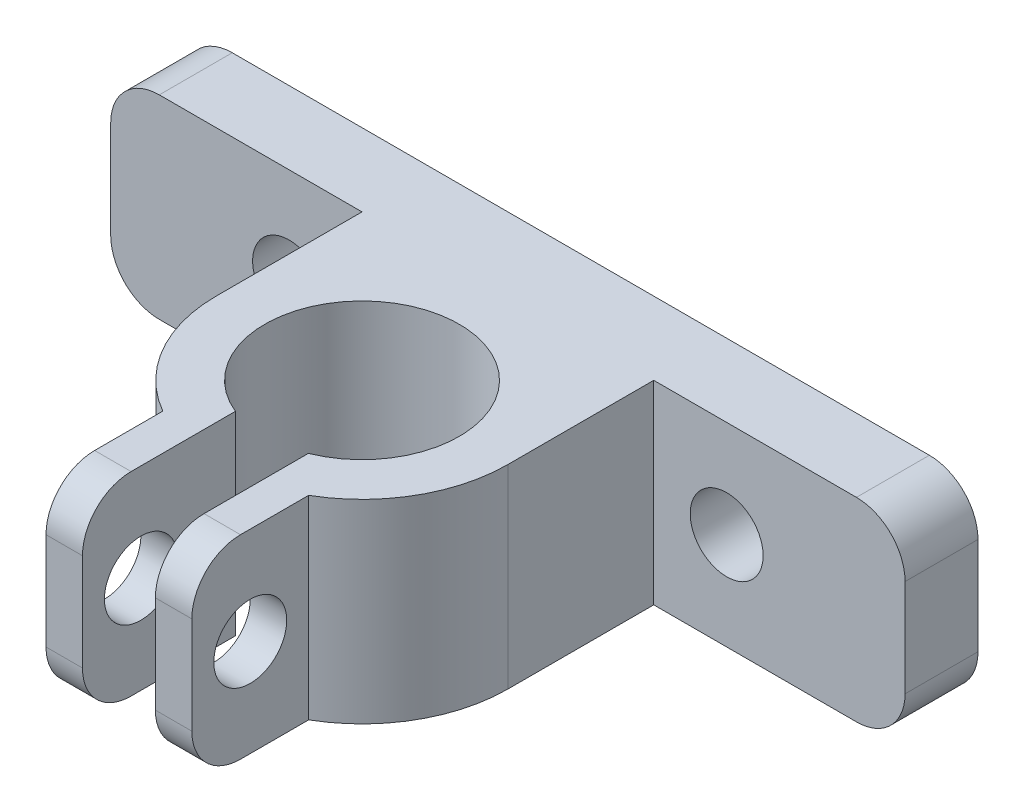
ISO-10303-21;
HEADER;
FILE_DESCRIPTION(('STEP AP214'),'2;1');
FILE_NAME('part.step','',(''),(''),'','','');
FILE_SCHEMA(('AUTOMOTIVE_DESIGN { 1 0 10303 214 1 1 1 1 }'));
ENDSEC;
DATA;
#1=APPLICATION_CONTEXT('core data for automotive mechanical design processes');
#2=APPLICATION_PROTOCOL_DEFINITION('international standard','automotive_design',2000,#1);
#3=PRODUCT_CONTEXT('',#1,'mechanical');
#4=PRODUCT('Part','Part','',(#3));
#5=PRODUCT_RELATED_PRODUCT_CATEGORY('part','',(#4));
#6=PRODUCT_DEFINITION_FORMATION('','',#4);
#7=PRODUCT_DEFINITION_CONTEXT('part definition',#1,'design');
#8=PRODUCT_DEFINITION('design','',#6,#7);
#9=PRODUCT_DEFINITION_SHAPE('','',#8);
#10=(LENGTH_UNIT() NAMED_UNIT(*) SI_UNIT(.MILLI.,.METRE.));
#11=(NAMED_UNIT(*) PLANE_ANGLE_UNIT() SI_UNIT($,.RADIAN.));
#12=(NAMED_UNIT(*) SI_UNIT($,.STERADIAN.) SOLID_ANGLE_UNIT());
#13=UNCERTAINTY_MEASURE_WITH_UNIT(LENGTH_MEASURE(1.E-05),#10,'distance_accuracy_value','');
#14=(GEOMETRIC_REPRESENTATION_CONTEXT(3) GLOBAL_UNCERTAINTY_ASSIGNED_CONTEXT((#13)) GLOBAL_UNIT_ASSIGNED_CONTEXT((#10,
#11,#12)) REPRESENTATION_CONTEXT('',''));
#15=CARTESIAN_POINT('',(0.,0.,0.));
#16=DIRECTION('',(0.,0.,1.));
#17=DIRECTION('',(1.,0.,0.));
#18=AXIS2_PLACEMENT_3D('',#15,#16,#17);
#19=CARTESIAN_POINT('',(-0.72669735327965,38.8438560633776,16.));
#20=DIRECTION('',(0.,0.,1.));
#21=DIRECTION('',(1.,0.,0.));
#22=AXIS2_PLACEMENT_3D('',#19,#20,#21);
#23=PLANE('',#22);
#24=DIRECTION('',(0.,1.,0.));
#25=VECTOR('',#24,1.);
#26=CARTESIAN_POINT('',(-2.22669735327965,38.8438560633776,16.));
#27=LINE('',#26,#25);
#28=CARTESIAN_POINT('',(-2.22669735327965,24.358574689139,16.));
#29=VERTEX_POINT('',#28);
#30=CARTESIAN_POINT('',(-2.22669735327965,28.358574689139,16.));
#31=VERTEX_POINT('',#30);
#32=EDGE_CURVE('E311',#29,#31,#27,.T.);
#33=ORIENTED_EDGE('',*,*,#32,.F.);
#34=DIRECTION('',(-1.,0.,0.));
#35=VECTOR('',#34,1.);
#36=CARTESIAN_POINT('',(-0.72669735327965,24.358574689139,16.));
#37=LINE('',#36,#35);
#38=CARTESIAN_POINT('',(-0.72669735327965,24.358574689139,16.));
#39=VERTEX_POINT('',#38);
#40=EDGE_CURVE('E66',#29,#39,#37,.F.);
#41=ORIENTED_EDGE('',*,*,#40,.T.);
#42=DIRECTION('',(0.,-1.,0.));
#43=VECTOR('',#42,1.);
#44=CARTESIAN_POINT('',(-0.72669735327965,38.8438560633776,16.));
#45=LINE('',#44,#43);
#46=CARTESIAN_POINT('',(-0.72669735327965,28.358574689139,16.));
#47=VERTEX_POINT('',#46);
#48=EDGE_CURVE('E384',#47,#39,#45,.T.);
#49=ORIENTED_EDGE('',*,*,#48,.F.);
#50=DIRECTION('',(-1.,0.,0.));
#51=VECTOR('',#50,1.);
#52=CARTESIAN_POINT('',(-0.726697353279648,28.358574689139,16.));
#53=LINE('',#52,#51);
#54=EDGE_CURVE('E380',#47,#31,#53,.T.);
#55=ORIENTED_EDGE('',*,*,#54,.T.);
#56=EDGE_LOOP('',(#33,#41,#49,#55));
#57=FACE_BOUND('',#56,.T.);
#58=ADVANCED_FACE('F51',(#57),#23,.T.);
#59=CARTESIAN_POINT('',(-3.72669735327962,47.3291374376162,6.));
#60=DIRECTION('',(0.,-1.,0.));
#61=DIRECTION('',(0.,0.,-1.));
#62=AXIS2_PLACEMENT_3D('',#59,#60,#61);
#63=CYLINDRICAL_SURFACE('',#62,6.);
#64=DIRECTION('',(0.,-1.,0.));
#65=VECTOR('',#64,1.);
#66=CARTESIAN_POINT('',(-6.72669735327966,47.3291374376162,11.1961524227066));
#67=LINE('',#66,#65);
#68=CARTESIAN_POINT('',(-6.72669735327966,30.358574689139,11.1961524227066));
#69=VERTEX_POINT('',#68);
#70=CARTESIAN_POINT('',(-6.72669735327966,22.358574689139,11.1961524227066));
#71=VERTEX_POINT('',#70);
#72=EDGE_CURVE('E305',#69,#71,#67,.T.);
#73=ORIENTED_EDGE('',*,*,#72,.F.);
#74=CARTESIAN_POINT('',(-3.72669735327962,30.358574689139,6.));
#75=DIRECTION('',(0.,1.,0.));
#76=DIRECTION('',(-1.,0.,0.));
#77=AXIS2_PLACEMENT_3D('',#74,#75,#76);
#78=CIRCLE('',#77,6.);
#79=CARTESIAN_POINT('',(-9.72669735327963,30.358574689139,6.));
#80=VERTEX_POINT('',#79);
#81=EDGE_CURVE('E252',#69,#80,#78,.F.);
#82=ORIENTED_EDGE('',*,*,#81,.T.);
#83=DIRECTION('',(0.,-1.,0.));
#84=VECTOR('',#83,1.);
#85=CARTESIAN_POINT('',(-9.72669735327963,38.8438560633776,6.));
#86=LINE('',#85,#84);
#87=CARTESIAN_POINT('',(-9.72669735327963,22.358574689139,6.));
#88=VERTEX_POINT('',#87);
#89=EDGE_CURVE('E246',#80,#88,#86,.T.);
#90=ORIENTED_EDGE('',*,*,#89,.T.);
#91=CARTESIAN_POINT('',(-3.72669735327962,22.358574689139,6.));
#92=DIRECTION('',(0.,-1.,0.));
#93=DIRECTION('',(0.,0.,-1.));
#94=AXIS2_PLACEMENT_3D('',#91,#92,#93);
#95=CIRCLE('',#94,6.);
#96=EDGE_CURVE('E243',#71,#88,#95,.T.);
#97=ORIENTED_EDGE('',*,*,#96,.F.);
#98=EDGE_LOOP('',(#73,#82,#90,#97));
#99=FACE_BOUND('',#98,.T.);
#100=ADVANCED_FACE('F503',(#99),#63,.T.);
#101=CARTESIAN_POINT('',(0.,0.,0.));
#102=DIRECTION('',(0.,0.,1.));
#103=DIRECTION('',(1.,0.,0.));
#104=AXIS2_PLACEMENT_3D('',#101,#102,#103);
#105=PLANE('',#104);
#106=CARTESIAN_POINT('',(5.27330264672038,26.358574689139,0.));
#107=DIRECTION('',(0.,0.,1.));
#108=DIRECTION('',(1.,0.,0.));
#109=AXIS2_PLACEMENT_3D('',#106,#107,#108);
#110=CIRCLE('',#109,1.5);
#111=CARTESIAN_POINT('',(6.77330264672038,26.358574689139,0.));
#112=VERTEX_POINT('',#111);
#113=EDGE_CURVE('E263',#112,#112,#110,.T.);
#114=ORIENTED_EDGE('',*,*,#113,.F.);
#115=EDGE_LOOP('',(#114));
#116=FACE_BOUND('',#115,.T.);
#117=DIRECTION('',(1.,0.,0.));
#118=VECTOR('',#117,1.);
#119=CARTESIAN_POINT('',(-20.0653915042754,22.358574689139,0.));
#120=LINE('',#119,#118);
#121=CARTESIAN_POINT('',(2.27330264672038,22.358574689139,0.));
#122=VERTEX_POINT('',#121);
#123=CARTESIAN_POINT('',(10.6119967977161,22.358574689139,0.));
#124=VERTEX_POINT('',#123);
#125=EDGE_CURVE('E301',#122,#124,#120,.T.);
#126=ORIENTED_EDGE('',*,*,#125,.T.);
#127=CARTESIAN_POINT('',(10.6119967977161,24.358574689139,0.));
#128=DIRECTION('',(0.,0.,1.));
#129=DIRECTION('',(1.,0.,0.));
#130=AXIS2_PLACEMENT_3D('',#127,#128,#129);
#131=CIRCLE('',#130,2.);
#132=CARTESIAN_POINT('',(12.6119967977161,24.358574689139,0.));
#133=VERTEX_POINT('',#132);
#134=EDGE_CURVE('E326',#124,#133,#131,.T.);
#135=ORIENTED_EDGE('',*,*,#134,.T.);
#136=DIRECTION('',(0.,1.,0.));
#137=VECTOR('',#136,1.);
#138=CARTESIAN_POINT('',(12.6119967977161,30.358574689139,0.));
#139=LINE('',#138,#137);
#140=CARTESIAN_POINT('',(12.6119967977161,28.358574689139,0.));
#141=VERTEX_POINT('',#140);
#142=EDGE_CURVE('E270',#133,#141,#139,.T.);
#143=ORIENTED_EDGE('',*,*,#142,.T.);
#144=CARTESIAN_POINT('',(10.6119967977161,28.358574689139,0.));
#145=DIRECTION('',(0.,0.,1.));
#146=DIRECTION('',(1.,0.,0.));
#147=AXIS2_PLACEMENT_3D('',#144,#145,#146);
#148=CIRCLE('',#147,2.);
#149=CARTESIAN_POINT('',(10.6119967977161,30.358574689139,0.));
#150=VERTEX_POINT('',#149);
#151=EDGE_CURVE('E324',#141,#150,#148,.T.);
#152=ORIENTED_EDGE('',*,*,#151,.T.);
#153=DIRECTION('',(-1.,0.,0.));
#154=VECTOR('',#153,1.);
#155=CARTESIAN_POINT('',(-20.0653915042754,30.358574689139,0.));
#156=LINE('',#155,#154);
#157=CARTESIAN_POINT('',(2.27330264672038,30.358574689139,0.));
#158=VERTEX_POINT('',#157);
#159=EDGE_CURVE('E296',#150,#158,#156,.T.);
#160=ORIENTED_EDGE('',*,*,#159,.T.);
#161=DIRECTION('',(0.,-1.,0.));
#162=VECTOR('',#161,1.);
#163=CARTESIAN_POINT('',(2.27330264672038,38.8438560633776,0.));
#164=LINE('',#163,#162);
#165=EDGE_CURVE('E255',#158,#122,#164,.T.);
#166=ORIENTED_EDGE('',*,*,#165,.T.);
#167=EDGE_LOOP('',(#126,#135,#143,#152,#160,#166));
#168=FACE_BOUND('',#167,.T.);
#169=ADVANCED_FACE('F462',(#116,#168),#105,.T.);
#170=CARTESIAN_POINT('',(12.6119967977161,30.358574689139,-3.));
#171=DIRECTION('',(1.,0.,0.));
#172=DIRECTION('',(0.,1.,0.));
#173=AXIS2_PLACEMENT_3D('',#170,#171,#172);
#174=PLANE('',#173);
#175=ORIENTED_EDGE('',*,*,#142,.F.);
#176=DIRECTION('',(0.,0.,1.));
#177=VECTOR('',#176,1.);
#178=CARTESIAN_POINT('',(12.6119967977161,24.358574689139,-3.));
#179=LINE('',#178,#177);
#180=CARTESIAN_POINT('',(12.6119967977161,24.358574689139,-3.));
#181=VERTEX_POINT('',#180);
#182=EDGE_CURVE('E331',#133,#181,#179,.F.);
#183=ORIENTED_EDGE('',*,*,#182,.T.);
#184=DIRECTION('',(0.,1.,0.));
#185=VECTOR('',#184,1.);
#186=CARTESIAN_POINT('',(12.6119967977161,30.358574689139,-3.));
#187=LINE('',#186,#185);
#188=CARTESIAN_POINT('',(12.6119967977161,28.358574689139,-3.));
#189=VERTEX_POINT('',#188);
#190=EDGE_CURVE('E279',#181,#189,#187,.T.);
#191=ORIENTED_EDGE('',*,*,#190,.T.);
#192=DIRECTION('',(0.,0.,1.));
#193=VECTOR('',#192,1.);
#194=CARTESIAN_POINT('',(12.6119967977161,28.358574689139,-3.));
#195=LINE('',#194,#193);
#196=EDGE_CURVE('E328',#189,#141,#195,.T.);
#197=ORIENTED_EDGE('',*,*,#196,.T.);
#198=EDGE_LOOP('',(#175,#183,#191,#197));
#199=FACE_BOUND('',#198,.T.);
#200=ADVANCED_FACE('F454',(#199),#174,.T.);
#201=CARTESIAN_POINT('',(-20.0653915042754,22.358574689139,-3.));
#202=DIRECTION('',(0.,-1.,0.));
#203=DIRECTION('',(0.,0.,-1.));
#204=AXIS2_PLACEMENT_3D('',#201,#202,#203);
#205=PLANE('',#204);
#206=DIRECTION('',(0.,0.,-1.));
#207=VECTOR('',#206,1.);
#208=CARTESIAN_POINT('',(-5.22669735327965,22.358574689139,6.));
#209=LINE('',#208,#207);
#210=CARTESIAN_POINT('',(-5.22669735327965,22.358574689139,14.));
#211=VERTEX_POINT('',#210);
#212=CARTESIAN_POINT('',(-5.22669735327965,22.358574689139,9.70809924354782));
#213=VERTEX_POINT('',#212);
#214=EDGE_CURVE('E234',#211,#213,#209,.T.);
#215=ORIENTED_EDGE('',*,*,#214,.F.);
#216=DIRECTION('',(-1.,0.,0.));
#217=VECTOR('',#216,1.);
#218=CARTESIAN_POINT('',(-20.0653915042754,22.358574689139,14.));
#219=LINE('',#218,#217);
#220=CARTESIAN_POINT('',(-6.72669735327966,22.358574689139,14.));
#221=VERTEX_POINT('',#220);
#222=EDGE_CURVE('E373',#211,#221,#219,.T.);
#223=ORIENTED_EDGE('',*,*,#222,.T.);
#224=DIRECTION('',(0.,0.,-1.));
#225=VECTOR('',#224,1.);
#226=CARTESIAN_POINT('',(-6.72669735327967,22.358574689139,10.));
#227=LINE('',#226,#225);
#228=EDGE_CURVE('E392',#221,#71,#227,.T.);
#229=ORIENTED_EDGE('',*,*,#228,.T.);
#230=ORIENTED_EDGE('',*,*,#96,.T.);
#231=DIRECTION('',(0.,0.,-1.));
#232=VECTOR('',#231,1.);
#233=CARTESIAN_POINT('',(-9.72669735327963,22.358574689139,6.));
#234=LINE('',#233,#232);
#235=CARTESIAN_POINT('',(-9.72669735327963,22.358574689139,0.));
#236=VERTEX_POINT('',#235);
#237=EDGE_CURVE('E241',#88,#236,#234,.T.);
#238=ORIENTED_EDGE('',*,*,#237,.T.);
#239=CARTESIAN_POINT('',(-18.0653915042754,22.358574689139,0.));
#240=VERTEX_POINT('',#239);
#241=EDGE_CURVE('E283',#240,#236,#120,.T.);
#242=ORIENTED_EDGE('',*,*,#241,.F.);
#243=DIRECTION('',(0.,0.,1.));
#244=VECTOR('',#243,1.);
#245=CARTESIAN_POINT('',(-18.0653915042754,22.358574689139,-3.));
#246=LINE('',#245,#244);
#247=CARTESIAN_POINT('',(-18.0653915042754,22.358574689139,-3.));
#248=VERTEX_POINT('',#247);
#249=EDGE_CURVE('E314',#240,#248,#246,.F.);
#250=ORIENTED_EDGE('',*,*,#249,.T.);
#251=DIRECTION('',(1.,0.,0.));
#252=VECTOR('',#251,1.);
#253=CARTESIAN_POINT('',(-20.0653915042754,22.358574689139,-3.));
#254=LINE('',#253,#252);
#255=CARTESIAN_POINT('',(10.6119967977161,22.358574689139,-3.));
#256=VERTEX_POINT('',#255);
#257=EDGE_CURVE('E289',#248,#256,#254,.T.);
#258=ORIENTED_EDGE('',*,*,#257,.T.);
#259=DIRECTION('',(0.,0.,1.));
#260=VECTOR('',#259,1.);
#261=CARTESIAN_POINT('',(10.6119967977161,22.358574689139,-3.));
#262=LINE('',#261,#260);
#263=EDGE_CURVE('E321',#256,#124,#262,.T.);
#264=ORIENTED_EDGE('',*,*,#263,.T.);
#265=ORIENTED_EDGE('',*,*,#125,.F.);
#266=DIRECTION('',(0.,0.,-1.));
#267=VECTOR('',#266,1.);
#268=CARTESIAN_POINT('',(2.27330264672038,22.358574689139,6.));
#269=LINE('',#268,#267);
#270=CARTESIAN_POINT('',(2.27330264672038,22.358574689139,6.));
#271=VERTEX_POINT('',#270);
#272=EDGE_CURVE('E256',#271,#122,#269,.T.);
#273=ORIENTED_EDGE('',*,*,#272,.F.);
#274=CARTESIAN_POINT('',(-0.726697353279651,22.358574689139,11.1961524227066));
#275=VERTEX_POINT('',#274);
#276=EDGE_CURVE('E249',#271,#275,#95,.T.);
#277=ORIENTED_EDGE('',*,*,#276,.T.);
#278=DIRECTION('',(0.,0.,1.));
#279=VECTOR('',#278,1.);
#280=CARTESIAN_POINT('',(-0.726697353279652,22.358574689139,10.));
#281=LINE('',#280,#279);
#282=CARTESIAN_POINT('',(-0.726697353279651,22.358574689139,14.));
#283=VERTEX_POINT('',#282);
#284=EDGE_CURVE('E222',#275,#283,#281,.T.);
#285=ORIENTED_EDGE('',*,*,#284,.T.);
#286=DIRECTION('',(-1.,0.,0.));
#287=VECTOR('',#286,1.);
#288=CARTESIAN_POINT('',(-20.0653915042754,22.358574689139,14.));
#289=LINE('',#288,#287);
#290=CARTESIAN_POINT('',(-2.22669735327964,22.358574689139,14.));
#291=VERTEX_POINT('',#290);
#292=EDGE_CURVE('E233',#283,#291,#289,.T.);
#293=ORIENTED_EDGE('',*,*,#292,.T.);
#294=DIRECTION('',(0.,0.,1.));
#295=VECTOR('',#294,1.);
#296=CARTESIAN_POINT('',(-2.2266973532796,22.358574689139,6.));
#297=LINE('',#296,#295);
#298=CARTESIAN_POINT('',(-2.22669735327962,22.358574689139,9.70809924354783));
#299=VERTEX_POINT('',#298);
#300=EDGE_CURVE('E215',#299,#291,#297,.T.);
#301=ORIENTED_EDGE('',*,*,#300,.F.);
#302=CARTESIAN_POINT('',(-3.72669735327962,22.358574689139,6.));
#303=DIRECTION('',(0.,-1.,0.));
#304=DIRECTION('',(0.,0.,-1.));
#305=AXIS2_PLACEMENT_3D('',#302,#303,#304);
#306=CIRCLE('',#305,4.);
#307=EDGE_CURVE('E230',#213,#299,#306,.T.);
#308=ORIENTED_EDGE('',*,*,#307,.F.);
#309=EDGE_LOOP('',(#215,#223,#229,#230,#238,#242,#250,#258,#264,#265,#273,#277,#285,#293,#301,#308));
#310=FACE_BOUND('',#309,.T.);
#311=ADVANCED_FACE('F229',(#310),#205,.T.);
#312=CARTESIAN_POINT('',(-20.0653915042754,30.358574689139,-3.));
#313=DIRECTION('',(-1.,0.,0.));
#314=DIRECTION('',(0.,0.,1.));
#315=AXIS2_PLACEMENT_3D('',#312,#313,#314);
#316=PLANE('',#315);
#317=DIRECTION('',(0.,-1.,0.));
#318=VECTOR('',#317,1.);
#319=CARTESIAN_POINT('',(-20.0653915042754,30.358574689139,-3.));
#320=LINE('',#319,#318);
#321=CARTESIAN_POINT('',(-20.0653915042754,28.358574689139,-3.));
#322=VERTEX_POINT('',#321);
#323=CARTESIAN_POINT('',(-20.0653915042754,24.358574689139,-3.));
#324=VERTEX_POINT('',#323);
#325=EDGE_CURVE('E286',#322,#324,#320,.T.);
#326=ORIENTED_EDGE('',*,*,#325,.T.);
#327=DIRECTION('',(0.,0.,1.));
#328=VECTOR('',#327,1.);
#329=CARTESIAN_POINT('',(-20.0653915042754,24.358574689139,-3.));
#330=LINE('',#329,#328);
#331=CARTESIAN_POINT('',(-20.0653915042754,24.358574689139,0.));
#332=VERTEX_POINT('',#331);
#333=EDGE_CURVE('E348',#324,#332,#330,.T.);
#334=ORIENTED_EDGE('',*,*,#333,.T.);
#335=DIRECTION('',(0.,-1.,0.));
#336=VECTOR('',#335,1.);
#337=CARTESIAN_POINT('',(-20.0653915042754,30.358574689139,0.));
#338=LINE('',#337,#336);
#339=CARTESIAN_POINT('',(-20.0653915042754,28.358574689139,0.));
#340=VERTEX_POINT('',#339);
#341=EDGE_CURVE('E298',#340,#332,#338,.T.);
#342=ORIENTED_EDGE('',*,*,#341,.F.);
#343=DIRECTION('',(0.,0.,1.));
#344=VECTOR('',#343,1.);
#345=CARTESIAN_POINT('',(-20.0653915042754,28.358574689139,-3.));
#346=LINE('',#345,#344);
#347=EDGE_CURVE('E346',#340,#322,#346,.F.);
#348=ORIENTED_EDGE('',*,*,#347,.T.);
#349=EDGE_LOOP('',(#326,#334,#342,#348));
#350=FACE_BOUND('',#349,.T.);
#351=ADVANCED_FACE('F440',(#350),#316,.T.);
#352=CARTESIAN_POINT('',(-20.0653915042754,30.358574689139,-3.));
#353=DIRECTION('',(0.,1.,0.));
#354=DIRECTION('',(-1.,0.,0.));
#355=AXIS2_PLACEMENT_3D('',#352,#353,#354);
#356=PLANE('',#355);
#357=DIRECTION('',(0.,0.,-1.));
#358=VECTOR('',#357,1.);
#359=CARTESIAN_POINT('',(-6.72669735327967,30.358574689139,10.));
#360=LINE('',#359,#358);
#361=CARTESIAN_POINT('',(-6.72669735327966,30.358574689139,14.));
#362=VERTEX_POINT('',#361);
#363=EDGE_CURVE('E399',#362,#69,#360,.T.);
#364=ORIENTED_EDGE('',*,*,#363,.F.);
#365=DIRECTION('',(-1.,0.,0.));
#366=VECTOR('',#365,1.);
#367=CARTESIAN_POINT('',(-20.0653915042754,30.358574689139,14.));
#368=LINE('',#367,#366);
#369=CARTESIAN_POINT('',(-5.22669735327965,30.358574689139,14.));
#370=VERTEX_POINT('',#369);
#371=EDGE_CURVE('E366',#362,#370,#368,.F.);
#372=ORIENTED_EDGE('',*,*,#371,.T.);
#373=DIRECTION('',(0.,0.,-1.));
#374=VECTOR('',#373,1.);
#375=CARTESIAN_POINT('',(-5.22669735327965,30.358574689139,6.));
#376=LINE('',#375,#374);
#377=CARTESIAN_POINT('',(-5.22669735327965,30.358574689139,9.70809924354782));
#378=VERTEX_POINT('',#377);
#379=EDGE_CURVE('E472',#370,#378,#376,.T.);
#380=ORIENTED_EDGE('',*,*,#379,.T.);
#381=CARTESIAN_POINT('',(-3.72669735327962,30.358574689139,6.));
#382=DIRECTION('',(0.,-1.,0.));
#383=DIRECTION('',(0.,0.,-1.));
#384=AXIS2_PLACEMENT_3D('',#381,#382,#383);
#385=CIRCLE('',#384,4.);
#386=CARTESIAN_POINT('',(-2.22669735327962,30.358574689139,9.70809924354783));
#387=VERTEX_POINT('',#386);
#388=EDGE_CURVE('E240',#378,#387,#385,.T.);
#389=ORIENTED_EDGE('',*,*,#388,.T.);
#390=DIRECTION('',(0.,0.,1.));
#391=VECTOR('',#390,1.);
#392=CARTESIAN_POINT('',(-2.2266973532796,30.358574689139,6.));
#393=LINE('',#392,#391);
#394=CARTESIAN_POINT('',(-2.22669735327964,30.358574689139,14.));
#395=VERTEX_POINT('',#394);
#396=EDGE_CURVE('E217',#387,#395,#393,.T.);
#397=ORIENTED_EDGE('',*,*,#396,.T.);
#398=DIRECTION('',(-1.,0.,0.));
#399=VECTOR('',#398,1.);
#400=CARTESIAN_POINT('',(-20.0653915042754,30.358574689139,14.));
#401=LINE('',#400,#399);
#402=CARTESIAN_POINT('',(-0.726697353279651,30.358574689139,14.));
#403=VERTEX_POINT('',#402);
#404=EDGE_CURVE('E364',#395,#403,#401,.F.);
#405=ORIENTED_EDGE('',*,*,#404,.T.);
#406=DIRECTION('',(0.,0.,1.));
#407=VECTOR('',#406,1.);
#408=CARTESIAN_POINT('',(-0.726697353279652,30.358574689139,10.));
#409=LINE('',#408,#407);
#410=CARTESIAN_POINT('',(-0.726697353279652,30.358574689139,11.1961524227066));
#411=VERTEX_POINT('',#410);
#412=EDGE_CURVE('E397',#411,#403,#409,.T.);
#413=ORIENTED_EDGE('',*,*,#412,.F.);
#414=CARTESIAN_POINT('',(2.27330264672038,30.358574689139,6.));
#415=VERTEX_POINT('',#414);
#416=EDGE_CURVE('E253',#415,#411,#78,.F.);
#417=ORIENTED_EDGE('',*,*,#416,.F.);
#418=DIRECTION('',(0.,0.,-1.));
#419=VECTOR('',#418,1.);
#420=CARTESIAN_POINT('',(2.27330264672038,30.358574689139,6.));
#421=LINE('',#420,#419);
#422=EDGE_CURVE('E259',#415,#158,#421,.T.);
#423=ORIENTED_EDGE('',*,*,#422,.T.);
#424=ORIENTED_EDGE('',*,*,#159,.F.);
#425=DIRECTION('',(0.,0.,1.));
#426=VECTOR('',#425,1.);
#427=CARTESIAN_POINT('',(10.6119967977161,30.358574689139,-3.));
#428=LINE('',#427,#426);
#429=CARTESIAN_POINT('',(10.6119967977161,30.358574689139,-3.));
#430=VERTEX_POINT('',#429);
#431=EDGE_CURVE('E344',#150,#430,#428,.F.);
#432=ORIENTED_EDGE('',*,*,#431,.T.);
#433=DIRECTION('',(-1.,0.,0.));
#434=VECTOR('',#433,1.);
#435=CARTESIAN_POINT('',(-20.0653915042754,30.358574689139,-3.));
#436=LINE('',#435,#434);
#437=CARTESIAN_POINT('',(-18.0653915042754,30.358574689139,-3.));
#438=VERTEX_POINT('',#437);
#439=EDGE_CURVE('E282',#430,#438,#436,.T.);
#440=ORIENTED_EDGE('',*,*,#439,.T.);
#441=DIRECTION('',(0.,0.,1.));
#442=VECTOR('',#441,1.);
#443=CARTESIAN_POINT('',(-18.0653915042754,30.358574689139,-3.));
#444=LINE('',#443,#442);
#445=CARTESIAN_POINT('',(-18.0653915042754,30.358574689139,0.));
#446=VERTEX_POINT('',#445);
#447=EDGE_CURVE('E341',#438,#446,#444,.T.);
#448=ORIENTED_EDGE('',*,*,#447,.T.);
#449=CARTESIAN_POINT('',(-9.72669735327963,30.358574689139,0.));
#450=VERTEX_POINT('',#449);
#451=EDGE_CURVE('E295',#450,#446,#156,.T.);
#452=ORIENTED_EDGE('',*,*,#451,.F.);
#453=DIRECTION('',(0.,0.,-1.));
#454=VECTOR('',#453,1.);
#455=CARTESIAN_POINT('',(-9.72669735327963,30.358574689139,6.));
#456=LINE('',#455,#454);
#457=EDGE_CURVE('E407',#80,#450,#456,.T.);
#458=ORIENTED_EDGE('',*,*,#457,.F.);
#459=ORIENTED_EDGE('',*,*,#81,.F.);
#460=EDGE_LOOP('',(#364,#372,#380,#389,#397,#405,#413,#417,#423,#424,#432,#440,#448,#452,#458,#459));
#461=FACE_BOUND('',#460,.T.);
#462=ADVANCED_FACE('F420',(#461),#356,.T.);
#463=CARTESIAN_POINT('',(0.,0.,-3.));
#464=DIRECTION('',(0.,0.,1.));
#465=DIRECTION('',(1.,0.,0.));
#466=AXIS2_PLACEMENT_3D('',#463,#464,#465);
#467=PLANE('',#466);
#468=CARTESIAN_POINT('',(-12.7266973532796,26.358574689139,-3.));
#469=DIRECTION('',(0.,0.,1.));
#470=DIRECTION('',(1.,0.,0.));
#471=AXIS2_PLACEMENT_3D('',#468,#469,#470);
#472=CIRCLE('',#471,1.5);
#473=CARTESIAN_POINT('',(-11.2266973532796,26.358574689139,-3.));
#474=VERTEX_POINT('',#473);
#475=EDGE_CURVE('E267',#474,#474,#472,.T.);
#476=ORIENTED_EDGE('',*,*,#475,.T.);
#477=EDGE_LOOP('',(#476));
#478=FACE_BOUND('',#477,.T.);
#479=CARTESIAN_POINT('',(5.27330264672038,26.358574689139,-3.));
#480=DIRECTION('',(0.,0.,1.));
#481=DIRECTION('',(1.,0.,0.));
#482=AXIS2_PLACEMENT_3D('',#479,#480,#481);
#483=CIRCLE('',#482,1.5);
#484=CARTESIAN_POINT('',(6.77330264672038,26.358574689139,-3.));
#485=VERTEX_POINT('',#484);
#486=EDGE_CURVE('E274',#485,#485,#483,.T.);
#487=ORIENTED_EDGE('',*,*,#486,.T.);
#488=EDGE_LOOP('',(#487));
#489=FACE_BOUND('',#488,.T.);
#490=ORIENTED_EDGE('',*,*,#190,.F.);
#491=CARTESIAN_POINT('',(10.6119967977161,24.358574689139,-3.));
#492=DIRECTION('',(0.,0.,1.));
#493=DIRECTION('',(1.,0.,0.));
#494=AXIS2_PLACEMENT_3D('',#491,#492,#493);
#495=CIRCLE('',#494,2.);
#496=EDGE_CURVE('E339',#181,#256,#495,.F.);
#497=ORIENTED_EDGE('',*,*,#496,.T.);
#498=ORIENTED_EDGE('',*,*,#257,.F.);
#499=CARTESIAN_POINT('',(-18.0653915042754,24.358574689139,-3.));
#500=DIRECTION('',(0.,0.,1.));
#501=DIRECTION('',(1.,0.,0.));
#502=AXIS2_PLACEMENT_3D('',#499,#500,#501);
#503=CIRCLE('',#502,2.);
#504=EDGE_CURVE('E335',#248,#324,#503,.F.);
#505=ORIENTED_EDGE('',*,*,#504,.T.);
#506=ORIENTED_EDGE('',*,*,#325,.F.);
#507=CARTESIAN_POINT('',(-18.0653915042754,28.358574689139,-3.));
#508=DIRECTION('',(0.,0.,1.));
#509=DIRECTION('',(1.,0.,0.));
#510=AXIS2_PLACEMENT_3D('',#507,#508,#509);
#511=CIRCLE('',#510,2.);
#512=EDGE_CURVE('E333',#322,#438,#511,.F.);
#513=ORIENTED_EDGE('',*,*,#512,.T.);
#514=ORIENTED_EDGE('',*,*,#439,.F.);
#515=CARTESIAN_POINT('',(10.6119967977161,28.358574689139,-3.));
#516=DIRECTION('',(0.,0.,1.));
#517=DIRECTION('',(1.,0.,0.));
#518=AXIS2_PLACEMENT_3D('',#515,#516,#517);
#519=CIRCLE('',#518,2.);
#520=EDGE_CURVE('E337',#430,#189,#519,.F.);
#521=ORIENTED_EDGE('',*,*,#520,.T.);
#522=EDGE_LOOP('',(#490,#497,#498,#505,#506,#513,#514,#521));
#523=FACE_BOUND('',#522,.T.);
#524=ADVANCED_FACE('F437',(#478,#489,#523),#467,.F.);
#525=ORIENTED_EDGE('',*,*,#341,.T.);
#526=CARTESIAN_POINT('',(-18.0653915042754,24.358574689139,0.));
#527=DIRECTION('',(0.,0.,1.));
#528=DIRECTION('',(1.,0.,0.));
#529=AXIS2_PLACEMENT_3D('',#526,#527,#528);
#530=CIRCLE('',#529,2.);
#531=EDGE_CURVE('E353',#332,#240,#530,.T.);
#532=ORIENTED_EDGE('',*,*,#531,.T.);
#533=ORIENTED_EDGE('',*,*,#241,.T.);
#534=DIRECTION('',(0.,-1.,0.));
#535=VECTOR('',#534,1.);
#536=CARTESIAN_POINT('',(-9.72669735327963,38.8438560633776,0.));
#537=LINE('',#536,#535);
#538=EDGE_CURVE('E404',#450,#236,#537,.T.);
#539=ORIENTED_EDGE('',*,*,#538,.F.);
#540=ORIENTED_EDGE('',*,*,#451,.T.);
#541=CARTESIAN_POINT('',(-18.0653915042754,28.358574689139,0.));
#542=DIRECTION('',(0.,0.,1.));
#543=DIRECTION('',(1.,0.,0.));
#544=AXIS2_PLACEMENT_3D('',#541,#542,#543);
#545=CIRCLE('',#544,2.);
#546=EDGE_CURVE('E351',#446,#340,#545,.T.);
#547=ORIENTED_EDGE('',*,*,#546,.T.);
#548=EDGE_LOOP('',(#525,#532,#533,#539,#540,#547));
#549=FACE_BOUND('',#548,.T.);
#550=CARTESIAN_POINT('',(-12.7266973532796,26.358574689139,0.));
#551=DIRECTION('',(0.,0.,1.));
#552=DIRECTION('',(1.,0.,0.));
#553=AXIS2_PLACEMENT_3D('',#550,#551,#552);
#554=CIRCLE('',#553,1.5);
#555=CARTESIAN_POINT('',(-11.2266973532796,26.358574689139,0.));
#556=VERTEX_POINT('',#555);
#557=EDGE_CURVE('E271',#556,#556,#554,.T.);
#558=ORIENTED_EDGE('',*,*,#557,.F.);
#559=EDGE_LOOP('',(#558));
#560=FACE_BOUND('',#559,.T.);
#561=ADVANCED_FACE('F424',(#549,#560),#105,.T.);
#562=CARTESIAN_POINT('',(5.27330264672038,26.358574689139,-3.));
#563=DIRECTION('',(0.,0.,1.));
#564=DIRECTION('',(1.,0.,0.));
#565=AXIS2_PLACEMENT_3D('',#562,#563,#564);
#566=CYLINDRICAL_SURFACE('',#565,1.5);
#567=ORIENTED_EDGE('',*,*,#486,.F.);
#568=EDGE_LOOP('',(#567));
#569=FACE_BOUND('',#568,.T.);
#570=ORIENTED_EDGE('',*,*,#113,.T.);
#571=EDGE_LOOP('',(#570));
#572=FACE_BOUND('',#571,.T.);
#573=ADVANCED_FACE('F561',(#569,#572),#566,.F.);
#574=CARTESIAN_POINT('',(-12.7266973532796,26.358574689139,-3.));
#575=DIRECTION('',(0.,0.,1.));
#576=DIRECTION('',(1.,0.,0.));
#577=AXIS2_PLACEMENT_3D('',#574,#575,#576);
#578=CYLINDRICAL_SURFACE('',#577,1.5);
#579=ORIENTED_EDGE('',*,*,#475,.F.);
#580=EDGE_LOOP('',(#579));
#581=FACE_BOUND('',#580,.T.);
#582=ORIENTED_EDGE('',*,*,#557,.T.);
#583=EDGE_LOOP('',(#582));
#584=FACE_BOUND('',#583,.T.);
#585=ADVANCED_FACE('F567',(#581,#584),#578,.F.);
#586=CARTESIAN_POINT('',(2.27330264672038,38.8438560633776,6.));
#587=DIRECTION('',(-1.,0.,0.));
#588=DIRECTION('',(0.,0.,1.));
#589=AXIS2_PLACEMENT_3D('',#586,#587,#588);
#590=PLANE('',#589);
#591=ORIENTED_EDGE('',*,*,#422,.F.);
#592=DIRECTION('',(0.,-1.,0.));
#593=VECTOR('',#592,1.);
#594=CARTESIAN_POINT('',(2.27330264672038,38.8438560633776,6.));
#595=LINE('',#594,#593);
#596=EDGE_CURVE('E260',#415,#271,#595,.T.);
#597=ORIENTED_EDGE('',*,*,#596,.T.);
#598=ORIENTED_EDGE('',*,*,#272,.T.);
#599=ORIENTED_EDGE('',*,*,#165,.F.);
#600=EDGE_LOOP('',(#591,#597,#598,#599));
#601=FACE_BOUND('',#600,.T.);
#602=ADVANCED_FACE('F466',(#601),#590,.F.);
#603=DIRECTION('',(0.,-1.,0.));
#604=VECTOR('',#603,1.);
#605=CARTESIAN_POINT('',(-0.726697353279652,47.3291374376162,11.1961524227066));
#606=LINE('',#605,#604);
#607=EDGE_CURVE('E292',#275,#411,#606,.F.);
#608=ORIENTED_EDGE('',*,*,#607,.F.);
#609=ORIENTED_EDGE('',*,*,#276,.F.);
#610=ORIENTED_EDGE('',*,*,#596,.F.);
#611=ORIENTED_EDGE('',*,*,#416,.T.);
#612=EDGE_LOOP('',(#608,#609,#610,#611));
#613=FACE_BOUND('',#612,.T.);
#614=ADVANCED_FACE('F470',(#613),#63,.T.);
#615=CARTESIAN_POINT('',(-3.72669735327962,30.358574689139,6.));
#616=DIRECTION('',(0.,-1.,0.));
#617=DIRECTION('',(0.,0.,-1.));
#618=AXIS2_PLACEMENT_3D('',#615,#616,#617);
#619=CYLINDRICAL_SURFACE('',#618,4.);
#620=ORIENTED_EDGE('',*,*,#307,.T.);
#621=DIRECTION('',(0.,-1.,0.));
#622=VECTOR('',#621,1.);
#623=CARTESIAN_POINT('',(-2.22669735327962,30.358574689139,9.70809924354783));
#624=LINE('',#623,#622);
#625=EDGE_CURVE('E212',#299,#387,#624,.F.);
#626=ORIENTED_EDGE('',*,*,#625,.T.);
#627=ORIENTED_EDGE('',*,*,#388,.F.);
#628=DIRECTION('',(0.,-1.,0.));
#629=VECTOR('',#628,1.);
#630=CARTESIAN_POINT('',(-5.22669735327965,30.358574689139,9.70809924354782));
#631=LINE('',#630,#629);
#632=EDGE_CURVE('E223',#378,#213,#631,.T.);
#633=ORIENTED_EDGE('',*,*,#632,.T.);
#634=EDGE_LOOP('',(#620,#626,#627,#633));
#635=FACE_BOUND('',#634,.T.);
#636=ADVANCED_FACE('F238',(#635),#619,.F.);
#637=CARTESIAN_POINT('',(-9.72669735327963,38.8438560633776,6.));
#638=DIRECTION('',(-1.,0.,0.));
#639=DIRECTION('',(0.,0.,1.));
#640=AXIS2_PLACEMENT_3D('',#637,#638,#639);
#641=PLANE('',#640);
#642=ORIENTED_EDGE('',*,*,#89,.F.);
#643=ORIENTED_EDGE('',*,*,#457,.T.);
#644=ORIENTED_EDGE('',*,*,#538,.T.);
#645=ORIENTED_EDGE('',*,*,#237,.F.);
#646=EDGE_LOOP('',(#642,#643,#644,#645));
#647=FACE_BOUND('',#646,.T.);
#648=ADVANCED_FACE('F414',(#647),#641,.T.);
#649=DIRECTION('',(0.,-1.,0.));
#650=VECTOR('',#649,1.);
#651=CARTESIAN_POINT('',(-5.22669735327965,38.8438560633776,16.));
#652=LINE('',#651,#650);
#653=CARTESIAN_POINT('',(-5.22669735327965,28.358574689139,16.));
#654=VERTEX_POINT('',#653);
#655=CARTESIAN_POINT('',(-5.22669735327965,24.358574689139,16.));
#656=VERTEX_POINT('',#655);
#657=EDGE_CURVE('E308',#654,#656,#652,.T.);
#658=ORIENTED_EDGE('',*,*,#657,.F.);
#659=DIRECTION('',(-1.,0.,0.));
#660=VECTOR('',#659,1.);
#661=CARTESIAN_POINT('',(-0.726697353279648,28.358574689139,16.));
#662=LINE('',#661,#660);
#663=CARTESIAN_POINT('',(-6.72669735327965,28.358574689139,16.));
#664=VERTEX_POINT('',#663);
#665=EDGE_CURVE('E357',#654,#664,#662,.T.);
#666=ORIENTED_EDGE('',*,*,#665,.T.);
#667=DIRECTION('',(0.,-1.,0.));
#668=VECTOR('',#667,1.);
#669=CARTESIAN_POINT('',(-6.72669735327965,38.8438560633776,16.));
#670=LINE('',#669,#668);
#671=CARTESIAN_POINT('',(-6.72669735327965,24.358574689139,16.));
#672=VERTEX_POINT('',#671);
#673=EDGE_CURVE('E394',#664,#672,#670,.T.);
#674=ORIENTED_EDGE('',*,*,#673,.T.);
#675=DIRECTION('',(-1.,0.,0.));
#676=VECTOR('',#675,1.);
#677=CARTESIAN_POINT('',(-0.72669735327965,24.358574689139,16.));
#678=LINE('',#677,#676);
#679=EDGE_CURVE('E355',#672,#656,#678,.F.);
#680=ORIENTED_EDGE('',*,*,#679,.T.);
#681=EDGE_LOOP('',(#658,#666,#674,#680));
#682=FACE_BOUND('',#681,.T.);
#683=ADVANCED_FACE('F498',(#682),#23,.T.);
#684=CARTESIAN_POINT('',(-6.72669735327967,38.8438560633776,10.));
#685=DIRECTION('',(-1.,0.,0.));
#686=DIRECTION('',(0.,0.,1.));
#687=AXIS2_PLACEMENT_3D('',#684,#685,#686);
#688=PLANE('',#687);
#689=CARTESIAN_POINT('',(-6.72669735327966,26.358574689139,13.5980762113533));
#690=DIRECTION('',(-1.,0.,0.));
#691=DIRECTION('',(0.,0.,1.));
#692=AXIS2_PLACEMENT_3D('',#689,#690,#691);
#693=CIRCLE('',#692,1.5);
#694=CARTESIAN_POINT('',(-6.72669735327965,26.358574689139,15.0980762113533));
#695=VERTEX_POINT('',#694);
#696=EDGE_CURVE('E235',#695,#695,#693,.T.);
#697=ORIENTED_EDGE('',*,*,#696,.F.);
#698=EDGE_LOOP('',(#697));
#699=FACE_BOUND('',#698,.T.);
#700=ORIENTED_EDGE('',*,*,#673,.F.);
#701=CARTESIAN_POINT('',(-6.72669735327966,28.358574689139,14.));
#702=DIRECTION('',(-1.,0.,0.));
#703=DIRECTION('',(0.,0.,1.));
#704=AXIS2_PLACEMENT_3D('',#701,#702,#703);
#705=CIRCLE('',#704,2.);
#706=EDGE_CURVE('E362',#664,#362,#705,.T.);
#707=ORIENTED_EDGE('',*,*,#706,.T.);
#708=ORIENTED_EDGE('',*,*,#363,.T.);
#709=ORIENTED_EDGE('',*,*,#72,.T.);
#710=ORIENTED_EDGE('',*,*,#228,.F.);
#711=CARTESIAN_POINT('',(-6.72669735327966,24.358574689139,14.));
#712=DIRECTION('',(-1.,0.,0.));
#713=DIRECTION('',(0.,0.,1.));
#714=AXIS2_PLACEMENT_3D('',#711,#712,#713);
#715=CIRCLE('',#714,2.);
#716=EDGE_CURVE('E360',#221,#672,#715,.T.);
#717=ORIENTED_EDGE('',*,*,#716,.T.);
#718=EDGE_LOOP('',(#700,#707,#708,#709,#710,#717));
#719=FACE_BOUND('',#718,.T.);
#720=ADVANCED_FACE('F490',(#699,#719),#688,.T.);
#721=CARTESIAN_POINT('',(-0.726697353279652,38.8438560633776,10.));
#722=DIRECTION('',(1.,0.,0.));
#723=DIRECTION('',(0.,0.,-1.));
#724=AXIS2_PLACEMENT_3D('',#721,#722,#723);
#725=PLANE('',#724);
#726=CARTESIAN_POINT('',(-0.726697353279657,26.358574689139,13.5980762113533));
#727=DIRECTION('',(1.,0.,0.));
#728=DIRECTION('',(0.,0.,-1.));
#729=AXIS2_PLACEMENT_3D('',#726,#727,#728);
#730=CIRCLE('',#729,1.5);
#731=CARTESIAN_POINT('',(-0.726697353279657,26.358574689139,12.0980762113533));
#732=VERTEX_POINT('',#731);
#733=EDGE_CURVE('E319',#732,#732,#730,.T.);
#734=ORIENTED_EDGE('',*,*,#733,.F.);
#735=EDGE_LOOP('',(#734));
#736=FACE_BOUND('',#735,.T.);
#737=ORIENTED_EDGE('',*,*,#48,.T.);
#738=CARTESIAN_POINT('',(-0.726697353279654,24.358574689139,14.));
#739=DIRECTION('',(1.,0.,0.));
#740=DIRECTION('',(0.,0.,-1.));
#741=AXIS2_PLACEMENT_3D('',#738,#739,#740);
#742=CIRCLE('',#741,2.);
#743=EDGE_CURVE('E12',#39,#283,#742,.T.);
#744=ORIENTED_EDGE('',*,*,#743,.T.);
#745=ORIENTED_EDGE('',*,*,#284,.F.);
#746=ORIENTED_EDGE('',*,*,#607,.T.);
#747=ORIENTED_EDGE('',*,*,#412,.T.);
#748=CARTESIAN_POINT('',(-0.726697353279651,28.358574689139,14.));
#749=DIRECTION('',(1.,0.,0.));
#750=DIRECTION('',(0.,0.,-1.));
#751=AXIS2_PLACEMENT_3D('',#748,#749,#750);
#752=CIRCLE('',#751,2.);
#753=EDGE_CURVE('E59',#403,#47,#752,.T.);
#754=ORIENTED_EDGE('',*,*,#753,.T.);
#755=EDGE_LOOP('',(#737,#744,#745,#746,#747,#754));
#756=FACE_BOUND('',#755,.T.);
#757=ADVANCED_FACE('F390',(#736,#756),#725,.T.);
#758=CARTESIAN_POINT('',(-5.22669735327965,30.358574689139,6.));
#759=DIRECTION('',(-1.,0.,0.));
#760=DIRECTION('',(0.,0.,1.));
#761=AXIS2_PLACEMENT_3D('',#758,#759,#760);
#762=PLANE('',#761);
#763=CARTESIAN_POINT('',(-5.22669735327965,26.358574689139,13.5980762113533));
#764=DIRECTION('',(-1.,0.,0.));
#765=DIRECTION('',(0.,0.,1.));
#766=AXIS2_PLACEMENT_3D('',#763,#764,#765);
#767=CIRCLE('',#766,1.5);
#768=CARTESIAN_POINT('',(-5.22669735327965,26.358574689139,15.0980762113533));
#769=VERTEX_POINT('',#768);
#770=EDGE_CURVE('E318',#769,#769,#767,.T.);
#771=ORIENTED_EDGE('',*,*,#770,.T.);
#772=EDGE_LOOP('',(#771));
#773=FACE_BOUND('',#772,.T.);
#774=ORIENTED_EDGE('',*,*,#379,.F.);
#775=CARTESIAN_POINT('',(-5.22669735327965,28.358574689139,14.));
#776=DIRECTION('',(-1.,0.,0.));
#777=DIRECTION('',(0.,0.,1.));
#778=AXIS2_PLACEMENT_3D('',#775,#776,#777);
#779=CIRCLE('',#778,2.);
#780=EDGE_CURVE('E370',#370,#654,#779,.F.);
#781=ORIENTED_EDGE('',*,*,#780,.T.);
#782=ORIENTED_EDGE('',*,*,#657,.T.);
#783=CARTESIAN_POINT('',(-5.22669735327965,24.358574689139,14.));
#784=DIRECTION('',(-1.,0.,0.));
#785=DIRECTION('',(0.,0.,1.));
#786=AXIS2_PLACEMENT_3D('',#783,#784,#785);
#787=CIRCLE('',#786,2.);
#788=EDGE_CURVE('E368',#656,#211,#787,.F.);
#789=ORIENTED_EDGE('',*,*,#788,.T.);
#790=ORIENTED_EDGE('',*,*,#214,.T.);
#791=ORIENTED_EDGE('',*,*,#632,.F.);
#792=EDGE_LOOP('',(#774,#781,#782,#789,#790,#791));
#793=FACE_BOUND('',#792,.T.);
#794=ADVANCED_FACE('F489',(#773,#793),#762,.F.);
#795=CARTESIAN_POINT('',(-2.2266973532796,30.358574689139,6.));
#796=DIRECTION('',(1.,0.,0.));
#797=DIRECTION('',(0.,0.,-1.));
#798=AXIS2_PLACEMENT_3D('',#795,#796,#797);
#799=PLANE('',#798);
#800=CARTESIAN_POINT('',(-2.22669735327964,26.358574689139,13.5980762113533));
#801=DIRECTION('',(1.,0.,0.));
#802=DIRECTION('',(0.,0.,-1.));
#803=AXIS2_PLACEMENT_3D('',#800,#801,#802);
#804=CIRCLE('',#803,1.5);
#805=CARTESIAN_POINT('',(-2.22669735327963,26.358574689139,12.0980762113533));
#806=VERTEX_POINT('',#805);
#807=EDGE_CURVE('E315',#806,#806,#804,.T.);
#808=ORIENTED_EDGE('',*,*,#807,.T.);
#809=EDGE_LOOP('',(#808));
#810=FACE_BOUND('',#809,.T.);
#811=ORIENTED_EDGE('',*,*,#300,.T.);
#812=CARTESIAN_POINT('',(-2.22669735327964,24.358574689139,14.));
#813=DIRECTION('',(1.,0.,0.));
#814=DIRECTION('',(0.,0.,-1.));
#815=AXIS2_PLACEMENT_3D('',#812,#813,#814);
#816=CIRCLE('',#815,2.);
#817=EDGE_CURVE('E378',#291,#29,#816,.F.);
#818=ORIENTED_EDGE('',*,*,#817,.T.);
#819=ORIENTED_EDGE('',*,*,#32,.T.);
#820=CARTESIAN_POINT('',(-2.22669735327964,28.358574689139,14.));
#821=DIRECTION('',(1.,0.,0.));
#822=DIRECTION('',(0.,0.,-1.));
#823=AXIS2_PLACEMENT_3D('',#820,#821,#822);
#824=CIRCLE('',#823,2.);
#825=EDGE_CURVE('E376',#31,#395,#824,.F.);
#826=ORIENTED_EDGE('',*,*,#825,.T.);
#827=ORIENTED_EDGE('',*,*,#396,.F.);
#828=ORIENTED_EDGE('',*,*,#625,.F.);
#829=EDGE_LOOP('',(#811,#818,#819,#826,#827,#828));
#830=FACE_BOUND('',#829,.T.);
#831=ADVANCED_FACE('F214',(#810,#830),#799,.F.);
#832=CARTESIAN_POINT('',(-20.0653915042754,26.358574689139,13.5980762113533));
#833=DIRECTION('',(1.,0.,0.));
#834=DIRECTION('',(0.,0.,-1.));
#835=AXIS2_PLACEMENT_3D('',#832,#833,#834);
#836=CYLINDRICAL_SURFACE('',#835,1.5);
#837=ORIENTED_EDGE('',*,*,#733,.T.);
#838=EDGE_LOOP('',(#837));
#839=FACE_BOUND('',#838,.T.);
#840=ORIENTED_EDGE('',*,*,#807,.F.);
#841=EDGE_LOOP('',(#840));
#842=FACE_BOUND('',#841,.T.);
#843=ADVANCED_FACE('F485',(#839,#842),#836,.F.);
#844=ORIENTED_EDGE('',*,*,#696,.T.);
#845=EDGE_LOOP('',(#844));
#846=FACE_BOUND('',#845,.T.);
#847=ORIENTED_EDGE('',*,*,#770,.F.);
#848=EDGE_LOOP('',(#847));
#849=FACE_BOUND('',#848,.T.);
#850=ADVANCED_FACE('F550',(#846,#849),#836,.F.);
#851=CARTESIAN_POINT('',(10.6119967977161,24.358574689139,-3.));
#852=DIRECTION('',(0.,0.,1.));
#853=DIRECTION('',(1.,0.,0.));
#854=AXIS2_PLACEMENT_3D('',#851,#852,#853);
#855=CYLINDRICAL_SURFACE('',#854,2.);
#856=ORIENTED_EDGE('',*,*,#496,.F.);
#857=ORIENTED_EDGE('',*,*,#182,.F.);
#858=ORIENTED_EDGE('',*,*,#134,.F.);
#859=ORIENTED_EDGE('',*,*,#263,.F.);
#860=EDGE_LOOP('',(#856,#857,#858,#859));
#861=FACE_BOUND('',#860,.T.);
#862=ADVANCED_FACE('F457',(#861),#855,.T.);
#863=CARTESIAN_POINT('',(10.6119967977161,28.358574689139,-3.));
#864=DIRECTION('',(0.,0.,1.));
#865=DIRECTION('',(1.,0.,0.));
#866=AXIS2_PLACEMENT_3D('',#863,#864,#865);
#867=CYLINDRICAL_SURFACE('',#866,2.);
#868=ORIENTED_EDGE('',*,*,#520,.F.);
#869=ORIENTED_EDGE('',*,*,#431,.F.);
#870=ORIENTED_EDGE('',*,*,#151,.F.);
#871=ORIENTED_EDGE('',*,*,#196,.F.);
#872=EDGE_LOOP('',(#868,#869,#870,#871));
#873=FACE_BOUND('',#872,.T.);
#874=ADVANCED_FACE('F449',(#873),#867,.T.);
#875=CARTESIAN_POINT('',(-18.0653915042754,24.358574689139,-3.));
#876=DIRECTION('',(0.,0.,1.));
#877=DIRECTION('',(1.,0.,0.));
#878=AXIS2_PLACEMENT_3D('',#875,#876,#877);
#879=CYLINDRICAL_SURFACE('',#878,2.);
#880=ORIENTED_EDGE('',*,*,#504,.F.);
#881=ORIENTED_EDGE('',*,*,#249,.F.);
#882=ORIENTED_EDGE('',*,*,#531,.F.);
#883=ORIENTED_EDGE('',*,*,#333,.F.);
#884=EDGE_LOOP('',(#880,#881,#882,#883));
#885=FACE_BOUND('',#884,.T.);
#886=ADVANCED_FACE('F432',(#885),#879,.T.);
#887=CARTESIAN_POINT('',(-18.0653915042754,28.358574689139,-3.));
#888=DIRECTION('',(0.,0.,1.));
#889=DIRECTION('',(1.,0.,0.));
#890=AXIS2_PLACEMENT_3D('',#887,#888,#889);
#891=CYLINDRICAL_SURFACE('',#890,2.);
#892=ORIENTED_EDGE('',*,*,#512,.F.);
#893=ORIENTED_EDGE('',*,*,#347,.F.);
#894=ORIENTED_EDGE('',*,*,#546,.F.);
#895=ORIENTED_EDGE('',*,*,#447,.F.);
#896=EDGE_LOOP('',(#892,#893,#894,#895));
#897=FACE_BOUND('',#896,.T.);
#898=ADVANCED_FACE('F443',(#897),#891,.T.);
#899=CARTESIAN_POINT('',(-0.726697353279648,28.358574689139,14.));
#900=DIRECTION('',(-1.,0.,0.));
#901=DIRECTION('',(0.,-1.,0.));
#902=AXIS2_PLACEMENT_3D('',#899,#900,#901);
#903=CYLINDRICAL_SURFACE('',#902,2.);
#904=ORIENTED_EDGE('',*,*,#780,.F.);
#905=ORIENTED_EDGE('',*,*,#371,.F.);
#906=ORIENTED_EDGE('',*,*,#706,.F.);
#907=ORIENTED_EDGE('',*,*,#665,.F.);
#908=EDGE_LOOP('',(#904,#905,#906,#907));
#909=FACE_BOUND('',#908,.T.);
#910=ADVANCED_FACE('F524',(#909),#903,.T.);
#911=CARTESIAN_POINT('',(-20.0653915042754,24.358574689139,14.));
#912=DIRECTION('',(-1.,0.,0.));
#913=DIRECTION('',(0.,0.,1.));
#914=AXIS2_PLACEMENT_3D('',#911,#912,#913);
#915=CYLINDRICAL_SURFACE('',#914,2.);
#916=ORIENTED_EDGE('',*,*,#788,.F.);
#917=ORIENTED_EDGE('',*,*,#679,.F.);
#918=ORIENTED_EDGE('',*,*,#716,.F.);
#919=ORIENTED_EDGE('',*,*,#222,.F.);
#920=EDGE_LOOP('',(#916,#917,#918,#919));
#921=FACE_BOUND('',#920,.T.);
#922=ADVANCED_FACE('F532',(#921),#915,.T.);
#923=CARTESIAN_POINT('',(-20.0653915042754,24.358574689139,14.));
#924=DIRECTION('',(-1.,0.,0.));
#925=DIRECTION('',(0.,0.,1.));
#926=AXIS2_PLACEMENT_3D('',#923,#924,#925);
#927=CYLINDRICAL_SURFACE('',#926,2.);
#928=ORIENTED_EDGE('',*,*,#743,.F.);
#929=ORIENTED_EDGE('',*,*,#40,.F.);
#930=ORIENTED_EDGE('',*,*,#817,.F.);
#931=ORIENTED_EDGE('',*,*,#292,.F.);
#932=EDGE_LOOP('',(#928,#929,#930,#931));
#933=FACE_BOUND('',#932,.T.);
#934=ADVANCED_FACE('F388',(#933),#927,.T.);
#935=CARTESIAN_POINT('',(-0.726697353279648,28.358574689139,14.));
#936=DIRECTION('',(-1.,0.,0.));
#937=DIRECTION('',(0.,-1.,0.));
#938=AXIS2_PLACEMENT_3D('',#935,#936,#937);
#939=CYLINDRICAL_SURFACE('',#938,2.);
#940=ORIENTED_EDGE('',*,*,#753,.F.);
#941=ORIENTED_EDGE('',*,*,#404,.F.);
#942=ORIENTED_EDGE('',*,*,#825,.F.);
#943=ORIENTED_EDGE('',*,*,#54,.F.);
#944=EDGE_LOOP('',(#940,#941,#942,#943));
#945=FACE_BOUND('',#944,.T.);
#946=ADVANCED_FACE('F53',(#945),#939,.T.);
#947=CLOSED_SHELL('',(#58,#100,#169,#200,#311,#351,#462,#524,#561,#573,#585,#602,#614,#636,#648,
#683,#720,#757,#794,#831,#843,#850,#862,#874,#886,#898,#910,#922,#934,#946));
#948=MANIFOLD_SOLID_BREP('B2',#947);
#949=ADVANCED_BREP_SHAPE_REPRESENTATION('',(#18,#948),#14);
#950=SHAPE_DEFINITION_REPRESENTATION(#9,#949);
ENDSEC;
END-ISO-10303-21;
